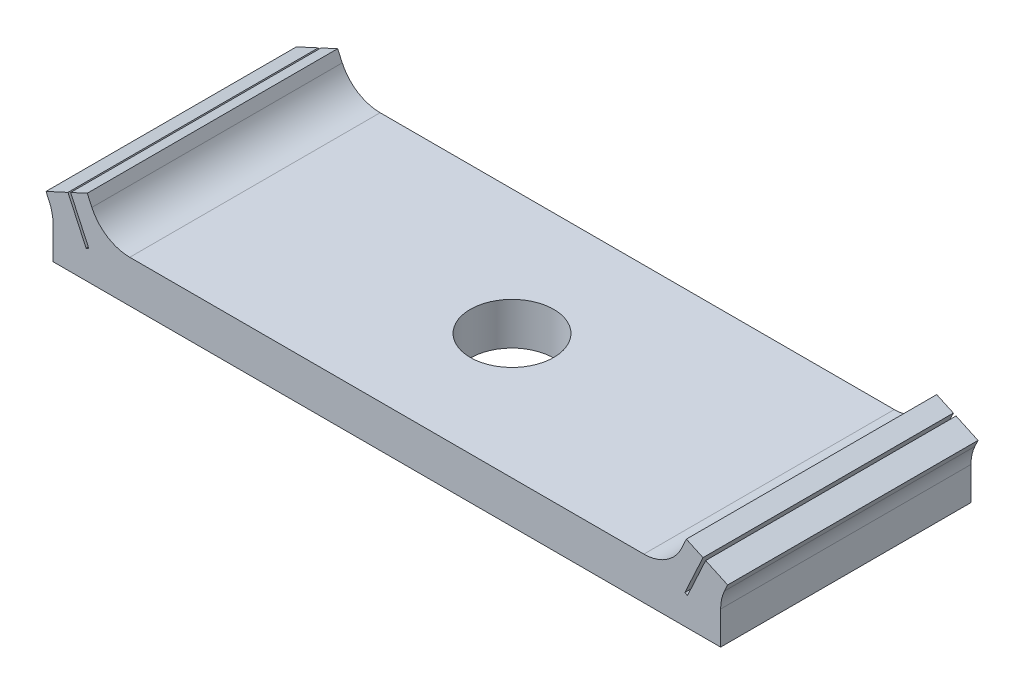
ISO-10303-21;
HEADER;
FILE_DESCRIPTION(('STEP AP214'),'2;1');
FILE_NAME('part.step','',(''),(''),'','','');
FILE_SCHEMA(('AUTOMOTIVE_DESIGN { 1 0 10303 214 1 1 1 1 }'));
ENDSEC;
DATA;
#1=APPLICATION_CONTEXT('core data for automotive mechanical design processes');
#2=APPLICATION_PROTOCOL_DEFINITION('international standard','automotive_design',2000,#1);
#3=PRODUCT_CONTEXT('',#1,'mechanical');
#4=PRODUCT('Part','Part','',(#3));
#5=PRODUCT_RELATED_PRODUCT_CATEGORY('part','',(#4));
#6=PRODUCT_DEFINITION_FORMATION('','',#4);
#7=PRODUCT_DEFINITION_CONTEXT('part definition',#1,'design');
#8=PRODUCT_DEFINITION('design','',#6,#7);
#9=PRODUCT_DEFINITION_SHAPE('','',#8);
#10=(LENGTH_UNIT() NAMED_UNIT(*) SI_UNIT(.MILLI.,.METRE.));
#11=(NAMED_UNIT(*) PLANE_ANGLE_UNIT() SI_UNIT($,.RADIAN.));
#12=(NAMED_UNIT(*) SI_UNIT($,.STERADIAN.) SOLID_ANGLE_UNIT());
#13=UNCERTAINTY_MEASURE_WITH_UNIT(LENGTH_MEASURE(1.E-05),#10,'distance_accuracy_value','');
#14=(GEOMETRIC_REPRESENTATION_CONTEXT(3) GLOBAL_UNCERTAINTY_ASSIGNED_CONTEXT((#13)) GLOBAL_UNIT_ASSIGNED_CONTEXT((#10,
#11,#12)) REPRESENTATION_CONTEXT('',''));
#15=CARTESIAN_POINT('',(0.,0.,0.));
#16=DIRECTION('',(0.,0.,1.));
#17=DIRECTION('',(1.,0.,0.));
#18=AXIS2_PLACEMENT_3D('',#15,#16,#17);
#19=CARTESIAN_POINT('',(0.,2.52883044287948,30.));
#20=DIRECTION('',(0.,1.,0.));
#21=DIRECTION('',(0.,0.,1.));
#22=AXIS2_PLACEMENT_3D('',#19,#20,#21);
#23=PLANE('',#22);
#24=CARTESIAN_POINT('',(0.,2.52883044287948,15.));
#25=DIRECTION('',(0.,1.,0.));
#26=DIRECTION('',(0.,0.,1.));
#27=AXIS2_PLACEMENT_3D('',#24,#25,#26);
#28=CIRCLE('',#27,5.);
#29=CARTESIAN_POINT('',(0.,2.52883044287948,20.));
#30=VERTEX_POINT('',#29);
#31=EDGE_CURVE('E513',#30,#30,#28,.T.);
#32=ORIENTED_EDGE('',*,*,#31,.F.);
#33=EDGE_LOOP('',(#32));
#34=FACE_BOUND('',#33,.T.);
#35=DIRECTION('',(1.,0.,0.));
#36=VECTOR('',#35,1.);
#37=CARTESIAN_POINT('',(0.,2.52883044287948,30.));
#38=LINE('',#37,#36);
#39=CARTESIAN_POINT('',(-30.8011368802658,2.52883044287948,30.));
#40=VERTEX_POINT('',#39);
#41=CARTESIAN_POINT('',(30.8011368802658,2.52883044287948,30.));
#42=VERTEX_POINT('',#41);
#43=EDGE_CURVE('E211',#40,#42,#38,.T.);
#44=ORIENTED_EDGE('',*,*,#43,.T.);
#45=DIRECTION('',(0.,0.,-1.));
#46=VECTOR('',#45,1.);
#47=CARTESIAN_POINT('',(30.8011368802658,2.52883044287948,30.));
#48=LINE('',#47,#46);
#49=CARTESIAN_POINT('',(30.8011368802658,2.52883044287948,0.));
#50=VERTEX_POINT('',#49);
#51=EDGE_CURVE('E394',#42,#50,#48,.T.);
#52=ORIENTED_EDGE('',*,*,#51,.T.);
#53=DIRECTION('',(1.,0.,0.));
#54=VECTOR('',#53,1.);
#55=CARTESIAN_POINT('',(0.,2.52883044287948,0.));
#56=LINE('',#55,#54);
#57=CARTESIAN_POINT('',(-30.8011368802658,2.52883044287948,0.));
#58=VERTEX_POINT('',#57);
#59=EDGE_CURVE('E272',#58,#50,#56,.T.);
#60=ORIENTED_EDGE('',*,*,#59,.F.);
#61=DIRECTION('',(0.,0.,-1.));
#62=VECTOR('',#61,1.);
#63=CARTESIAN_POINT('',(-30.8011368802658,2.52883044287948,30.));
#64=LINE('',#63,#62);
#65=EDGE_CURVE('E391',#58,#40,#64,.F.);
#66=ORIENTED_EDGE('',*,*,#65,.T.);
#67=EDGE_LOOP('',(#44,#52,#60,#66));
#68=FACE_BOUND('',#67,.T.);
#69=ADVANCED_FACE('F44',(#34,#68),#23,.T.);
#70=CARTESIAN_POINT('',(-27.0647454715438,-12.4942055104958,30.));
#71=DIRECTION('',(0.907923839622832,0.419135182780608,0.));
#72=DIRECTION('',(-0.419135182780608,0.907923839622832,0.));
#73=AXIS2_PLACEMENT_3D('',#70,#71,#72);
#74=PLANE('',#73);
#75=DIRECTION('',(0.419135182780608,-0.907923839622832,0.));
#76=VECTOR('',#75,1.);
#77=CARTESIAN_POINT('',(-27.0647454715438,-12.4942055104958,30.));
#78=LINE('',#77,#76);
#79=CARTESIAN_POINT('',(-35.8923161742284,6.62793506895229,30.));
#80=VERTEX_POINT('',#79);
#81=CARTESIAN_POINT('',(-35.3407560783799,5.43315452897644,30.));
#82=VERTEX_POINT('',#81);
#83=EDGE_CURVE('E196',#80,#82,#78,.T.);
#84=ORIENTED_EDGE('',*,*,#83,.T.);
#85=DIRECTION('',(0.,0.,-1.));
#86=VECTOR('',#85,1.);
#87=CARTESIAN_POINT('',(-35.3407560783799,5.43315452897644,0.));
#88=LINE('',#87,#86);
#89=CARTESIAN_POINT('',(-35.3407560783799,5.43315452897644,0.));
#90=VERTEX_POINT('',#89);
#91=EDGE_CURVE('E401',#82,#90,#88,.T.);
#92=ORIENTED_EDGE('',*,*,#91,.T.);
#93=DIRECTION('',(0.419135182780608,-0.907923839622832,0.));
#94=VECTOR('',#93,1.);
#95=CARTESIAN_POINT('',(-27.0647454715438,-12.4942055104958,0.));
#96=LINE('',#95,#94);
#97=CARTESIAN_POINT('',(-35.8923161742284,6.62793506895229,0.));
#98=VERTEX_POINT('',#97);
#99=EDGE_CURVE('E198',#98,#90,#96,.T.);
#100=ORIENTED_EDGE('',*,*,#99,.F.);
#101=DIRECTION('',(0.,0.,-1.));
#102=VECTOR('',#101,1.);
#103=CARTESIAN_POINT('',(-35.8923161742284,6.62793506895229,30.));
#104=LINE('',#103,#102);
#105=EDGE_CURVE('E194',#80,#98,#104,.T.);
#106=ORIENTED_EDGE('',*,*,#105,.F.);
#107=EDGE_LOOP('',(#84,#92,#100,#106));
#108=FACE_BOUND('',#107,.T.);
#109=ADVANCED_FACE('F195',(#108),#74,.T.);
#110=CARTESIAN_POINT('',(-8.82757070268477,19.1221405794482,30.));
#111=DIRECTION('',(-0.419135182780611,0.907923839622831,0.));
#112=DIRECTION('',(-0.907923839622831,-0.419135182780611,0.));
#113=AXIS2_PLACEMENT_3D('',#110,#111,#112);
#114=PLANE('',#113);
#115=DIRECTION('',(0.907923839622831,0.419135182780611,0.));
#116=VECTOR('',#115,1.);
#117=CARTESIAN_POINT('',(-8.82757070268477,19.1221405794482,0.));
#118=LINE('',#117,#116);
#119=CARTESIAN_POINT('',(-37.887517886787,5.70686746616213,0.));
#120=VERTEX_POINT('',#119);
#121=EDGE_CURVE('E278',#120,#98,#118,.T.);
#122=ORIENTED_EDGE('',*,*,#121,.F.);
#123=DIRECTION('',(0.,0.,-1.));
#124=VECTOR('',#123,1.);
#125=CARTESIAN_POINT('',(-37.887517886787,5.70686746616213,30.));
#126=LINE('',#125,#124);
#127=CARTESIAN_POINT('',(-37.887517886787,5.70686746616213,30.));
#128=VERTEX_POINT('',#127);
#129=EDGE_CURVE('E205',#128,#120,#126,.T.);
#130=ORIENTED_EDGE('',*,*,#129,.F.);
#131=DIRECTION('',(0.907923839622831,0.419135182780611,0.));
#132=VECTOR('',#131,1.);
#133=CARTESIAN_POINT('',(-8.82757070268477,19.1221405794482,30.));
#134=LINE('',#133,#132);
#135=EDGE_CURVE('E209',#128,#80,#134,.T.);
#136=ORIENTED_EDGE('',*,*,#135,.T.);
#137=ORIENTED_EDGE('',*,*,#105,.T.);
#138=EDGE_LOOP('',(#122,#130,#136,#137));
#139=FACE_BOUND('',#138,.T.);
#140=ADVANCED_FACE('F213',(#139),#114,.T.);
#141=CARTESIAN_POINT('',(-29.0599471841023,-13.4152731132861,30.));
#142=DIRECTION('',(0.907923839622831,0.419135182780611,0.));
#143=DIRECTION('',(-0.419135182780611,0.907923839622831,0.));
#144=AXIS2_PLACEMENT_3D('',#141,#142,#143);
#145=PLANE('',#144);
#146=DIRECTION('',(0.419135182780611,-0.907923839622831,0.));
#147=VECTOR('',#146,1.);
#148=CARTESIAN_POINT('',(-29.0599471841023,-13.4152731132861,0.));
#149=LINE('',#148,#147);
#150=CARTESIAN_POINT('',(-35.7080149363278,0.985663500123416,0.));
#151=VERTEX_POINT('',#150);
#152=EDGE_CURVE('E281',#120,#151,#149,.T.);
#153=ORIENTED_EDGE('',*,*,#152,.T.);
#154=DIRECTION('',(0.,0.,-1.));
#155=VECTOR('',#154,1.);
#156=CARTESIAN_POINT('',(-35.7080149363278,0.985663500123416,30.));
#157=LINE('',#156,#155);
#158=CARTESIAN_POINT('',(-35.7080149363278,0.985663500123416,30.));
#159=VERTEX_POINT('',#158);
#160=EDGE_CURVE('E372',#159,#151,#157,.T.);
#161=ORIENTED_EDGE('',*,*,#160,.F.);
#162=DIRECTION('',(0.419135182780611,-0.907923839622831,0.));
#163=VECTOR('',#162,1.);
#164=CARTESIAN_POINT('',(-29.0599471841023,-13.4152731132861,30.));
#165=LINE('',#164,#163);
#166=EDGE_CURVE('E216',#128,#159,#165,.T.);
#167=ORIENTED_EDGE('',*,*,#166,.F.);
#168=ORIENTED_EDGE('',*,*,#129,.T.);
#169=EDGE_LOOP('',(#153,#161,#167,#168));
#170=FACE_BOUND('',#169,.T.);
#171=ADVANCED_FACE('F547',(#170),#145,.F.);
#172=CARTESIAN_POINT('',(-6.64806775222578,14.4009366134096,30.));
#173=DIRECTION('',(0.419135182780618,-0.907923839622828,0.));
#174=DIRECTION('',(0.907923839622828,0.419135182780618,0.));
#175=AXIS2_PLACEMENT_3D('',#172,#173,#174);
#176=PLANE('',#175);
#177=DIRECTION('',(-0.907923839622828,-0.419135182780618,0.));
#178=VECTOR('',#177,1.);
#179=CARTESIAN_POINT('',(-6.64806775222578,14.4009366134096,0.));
#180=LINE('',#179,#178);
#181=CARTESIAN_POINT('',(-36.0257882801958,0.838966186150199,0.));
#182=VERTEX_POINT('',#181);
#183=EDGE_CURVE('E284',#151,#182,#180,.T.);
#184=ORIENTED_EDGE('',*,*,#183,.T.);
#185=DIRECTION('',(0.,0.,-1.));
#186=VECTOR('',#185,1.);
#187=CARTESIAN_POINT('',(-36.0257882801958,0.838966186150199,30.));
#188=LINE('',#187,#186);
#189=CARTESIAN_POINT('',(-36.0257882801958,0.838966186150199,30.));
#190=VERTEX_POINT('',#189);
#191=EDGE_CURVE('E368',#190,#182,#188,.T.);
#192=ORIENTED_EDGE('',*,*,#191,.F.);
#193=DIRECTION('',(-0.907923839622828,-0.419135182780618,0.));
#194=VECTOR('',#193,1.);
#195=CARTESIAN_POINT('',(-6.64806775222578,14.4009366134096,30.));
#196=LINE('',#195,#194);
#197=EDGE_CURVE('E219',#159,#190,#196,.T.);
#198=ORIENTED_EDGE('',*,*,#197,.F.);
#199=ORIENTED_EDGE('',*,*,#160,.T.);
#200=EDGE_LOOP('',(#184,#192,#198,#199));
#201=FACE_BOUND('',#200,.T.);
#202=ADVANCED_FACE('F543',(#201),#176,.F.);
#203=CARTESIAN_POINT('',(-29.3777205279702,-13.5619704272593,30.));
#204=DIRECTION('',(-0.90792383962283,-0.419135182780612,0.));
#205=DIRECTION('',(0.419135182780612,-0.90792383962283,0.));
#206=AXIS2_PLACEMENT_3D('',#203,#204,#205);
#207=PLANE('',#206);
#208=DIRECTION('',(-0.419135182780612,0.90792383962283,0.));
#209=VECTOR('',#208,1.);
#210=CARTESIAN_POINT('',(-29.3777205279702,-13.5619704272593,0.));
#211=LINE('',#210,#209);
#212=CARTESIAN_POINT('',(-38.205291230655,5.56017015218892,0.));
#213=VERTEX_POINT('',#212);
#214=EDGE_CURVE('E287',#182,#213,#211,.T.);
#215=ORIENTED_EDGE('',*,*,#214,.T.);
#216=DIRECTION('',(0.,0.,-1.));
#217=VECTOR('',#216,1.);
#218=CARTESIAN_POINT('',(-38.205291230655,5.56017015218892,30.));
#219=LINE('',#218,#217);
#220=CARTESIAN_POINT('',(-38.205291230655,5.56017015218892,30.));
#221=VERTEX_POINT('',#220);
#222=EDGE_CURVE('E365',#221,#213,#219,.T.);
#223=ORIENTED_EDGE('',*,*,#222,.F.);
#224=DIRECTION('',(-0.419135182780612,0.90792383962283,0.));
#225=VECTOR('',#224,1.);
#226=CARTESIAN_POINT('',(-29.3777205279702,-13.5619704272593,30.));
#227=LINE('',#226,#225);
#228=EDGE_CURVE('E225',#190,#221,#227,.T.);
#229=ORIENTED_EDGE('',*,*,#228,.F.);
#230=ORIENTED_EDGE('',*,*,#191,.T.);
#231=EDGE_LOOP('',(#215,#223,#229,#230));
#232=FACE_BOUND('',#231,.T.);
#233=ADVANCED_FACE('F539',(#232),#207,.F.);
#234=CARTESIAN_POINT('',(-8.82757070268477,19.1221405794482,30.));
#235=DIRECTION('',(-0.419135182780611,0.907923839622831,0.));
#236=DIRECTION('',(-0.907923839622831,-0.419135182780611,0.));
#237=AXIS2_PLACEMENT_3D('',#234,#235,#236);
#238=PLANE('',#237);
#239=DIRECTION('',(0.907923839622831,0.419135182780611,0.));
#240=VECTOR('',#239,1.);
#241=CARTESIAN_POINT('',(-8.82757070268477,19.1221405794482,0.));
#242=LINE('',#241,#240);
#243=CARTESIAN_POINT('',(-40.8382703655612,4.34467812212515,0.));
#244=VERTEX_POINT('',#243);
#245=EDGE_CURVE('E291',#244,#213,#242,.T.);
#246=ORIENTED_EDGE('',*,*,#245,.F.);
#247=DIRECTION('',(0.,0.,-1.));
#248=VECTOR('',#247,1.);
#249=CARTESIAN_POINT('',(-40.8382703655612,4.34467812212515,30.));
#250=LINE('',#249,#248);
#251=CARTESIAN_POINT('',(-40.8382703655612,4.34467812212515,30.));
#252=VERTEX_POINT('',#251);
#253=EDGE_CURVE('E361',#252,#244,#250,.T.);
#254=ORIENTED_EDGE('',*,*,#253,.F.);
#255=DIRECTION('',(0.907923839622831,0.419135182780611,0.));
#256=VECTOR('',#255,1.);
#257=CARTESIAN_POINT('',(-8.82757070268477,19.1221405794482,30.));
#258=LINE('',#257,#256);
#259=EDGE_CURVE('E228',#252,#221,#258,.T.);
#260=ORIENTED_EDGE('',*,*,#259,.T.);
#261=ORIENTED_EDGE('',*,*,#222,.T.);
#262=EDGE_LOOP('',(#246,#254,#260,#261));
#263=FACE_BOUND('',#262,.T.);
#264=ADVANCED_FACE('F535',(#263),#238,.T.);
#265=CARTESIAN_POINT('',(-32.0106996628765,-14.777462457323,30.));
#266=DIRECTION('',(-0.907923839622831,-0.419135182780611,0.));
#267=DIRECTION('',(0.419135182780611,-0.907923839622831,0.));
#268=AXIS2_PLACEMENT_3D('',#265,#266,#267);
#269=PLANE('',#268);
#270=DIRECTION('',(-0.419135182780611,0.907923839622831,0.));
#271=VECTOR('',#270,1.);
#272=CARTESIAN_POINT('',(-32.0106996628765,-14.777462457323,0.));
#273=LINE('',#272,#271);
#274=CARTESIAN_POINT('',(-40.4603808018859,3.52609987410171,0.));
#275=VERTEX_POINT('',#274);
#276=EDGE_CURVE('E295',#275,#244,#273,.T.);
#277=ORIENTED_EDGE('',*,*,#276,.F.);
#278=DIRECTION('',(0.,0.,-1.));
#279=VECTOR('',#278,1.);
#280=CARTESIAN_POINT('',(-40.4603808018859,3.52609987410171,30.));
#281=LINE('',#280,#279);
#282=CARTESIAN_POINT('',(-40.4603808018859,3.52609987410171,30.));
#283=VERTEX_POINT('',#282);
#284=EDGE_CURVE('E388',#275,#283,#281,.F.);
#285=ORIENTED_EDGE('',*,*,#284,.T.);
#286=DIRECTION('',(-0.419135182780611,0.907923839622831,0.));
#287=VECTOR('',#286,1.);
#288=CARTESIAN_POINT('',(-32.0106996628765,-14.777462457323,30.));
#289=LINE('',#288,#287);
#290=EDGE_CURVE('E232',#283,#252,#289,.T.);
#291=ORIENTED_EDGE('',*,*,#290,.T.);
#292=ORIENTED_EDGE('',*,*,#253,.T.);
#293=EDGE_LOOP('',(#277,#285,#291,#292));
#294=FACE_BOUND('',#293,.T.);
#295=ADVANCED_FACE('F529',(#294),#269,.T.);
#296=CARTESIAN_POINT('',(-40.,0.,30.));
#297=DIRECTION('',(-1.,0.,0.));
#298=DIRECTION('',(0.,-1.,0.));
#299=AXIS2_PLACEMENT_3D('',#296,#297,#298);
#300=PLANE('',#299);
#301=DIRECTION('',(0.,1.,0.));
#302=VECTOR('',#301,1.);
#303=CARTESIAN_POINT('',(-40.,0.,30.));
#304=LINE('',#303,#302);
#305=CARTESIAN_POINT('',(-40.,-2.52883044287948,30.));
#306=VERTEX_POINT('',#305);
#307=CARTESIAN_POINT('',(-40.,1.43042396019865,30.));
#308=VERTEX_POINT('',#307);
#309=EDGE_CURVE('E235',#306,#308,#304,.T.);
#310=ORIENTED_EDGE('',*,*,#309,.T.);
#311=DIRECTION('',(0.,0.,-1.));
#312=VECTOR('',#311,1.);
#313=CARTESIAN_POINT('',(-40.,1.43042396019865,0.));
#314=LINE('',#313,#312);
#315=CARTESIAN_POINT('',(-40.,1.43042396019865,0.));
#316=VERTEX_POINT('',#315);
#317=EDGE_CURVE('E384',#308,#316,#314,.T.);
#318=ORIENTED_EDGE('',*,*,#317,.T.);
#319=DIRECTION('',(0.,1.,0.));
#320=VECTOR('',#319,1.);
#321=CARTESIAN_POINT('',(-40.,0.,0.));
#322=LINE('',#321,#320);
#323=CARTESIAN_POINT('',(-40.,-2.52883044287948,0.));
#324=VERTEX_POINT('',#323);
#325=EDGE_CURVE('E298',#324,#316,#322,.T.);
#326=ORIENTED_EDGE('',*,*,#325,.F.);
#327=DIRECTION('',(0.,0.,-1.));
#328=VECTOR('',#327,1.);
#329=CARTESIAN_POINT('',(-40.,-2.52883044287948,30.));
#330=LINE('',#329,#328);
#331=EDGE_CURVE('E358',#306,#324,#330,.T.);
#332=ORIENTED_EDGE('',*,*,#331,.F.);
#333=EDGE_LOOP('',(#310,#318,#326,#332));
#334=FACE_BOUND('',#333,.T.);
#335=ADVANCED_FACE('F466',(#334),#300,.T.);
#336=CARTESIAN_POINT('',(0.,-2.52883044287948,30.));
#337=DIRECTION('',(0.,1.,0.));
#338=DIRECTION('',(0.,0.,1.));
#339=AXIS2_PLACEMENT_3D('',#336,#337,#338);
#340=PLANE('',#339);
#341=CARTESIAN_POINT('',(0.,-2.52883044287948,15.));
#342=DIRECTION('',(0.,1.,0.));
#343=DIRECTION('',(0.,0.,1.));
#344=AXIS2_PLACEMENT_3D('',#341,#342,#343);
#345=CIRCLE('',#344,5.);
#346=CARTESIAN_POINT('',(0.,-2.52883044287948,20.));
#347=VERTEX_POINT('',#346);
#348=EDGE_CURVE('E48',#347,#347,#345,.T.);
#349=ORIENTED_EDGE('',*,*,#348,.T.);
#350=EDGE_LOOP('',(#349));
#351=FACE_BOUND('',#350,.T.);
#352=DIRECTION('',(1.,0.,0.));
#353=VECTOR('',#352,1.);
#354=CARTESIAN_POINT('',(0.,-2.52883044287948,0.));
#355=LINE('',#354,#353);
#356=CARTESIAN_POINT('',(40.,-2.52883044287948,0.));
#357=VERTEX_POINT('',#356);
#358=EDGE_CURVE('E302',#324,#357,#355,.T.);
#359=ORIENTED_EDGE('',*,*,#358,.T.);
#360=DIRECTION('',(0.,0.,-1.));
#361=VECTOR('',#360,1.);
#362=CARTESIAN_POINT('',(40.,-2.52883044287948,30.));
#363=LINE('',#362,#361);
#364=CARTESIAN_POINT('',(40.,-2.52883044287948,30.));
#365=VERTEX_POINT('',#364);
#366=EDGE_CURVE('E354',#365,#357,#363,.T.);
#367=ORIENTED_EDGE('',*,*,#366,.F.);
#368=DIRECTION('',(1.,0.,0.));
#369=VECTOR('',#368,1.);
#370=CARTESIAN_POINT('',(0.,-2.52883044287948,30.));
#371=LINE('',#370,#369);
#372=EDGE_CURVE('E239',#306,#365,#371,.T.);
#373=ORIENTED_EDGE('',*,*,#372,.F.);
#374=ORIENTED_EDGE('',*,*,#331,.T.);
#375=EDGE_LOOP('',(#359,#367,#373,#374));
#376=FACE_BOUND('',#375,.T.);
#377=ADVANCED_FACE('F472',(#351,#376),#340,.F.);
#378=CARTESIAN_POINT('',(40.,0.,30.));
#379=DIRECTION('',(-1.,0.,0.));
#380=DIRECTION('',(0.,0.,1.));
#381=AXIS2_PLACEMENT_3D('',#378,#379,#380);
#382=PLANE('',#381);
#383=DIRECTION('',(0.,1.,0.));
#384=VECTOR('',#383,1.);
#385=CARTESIAN_POINT('',(40.,0.,0.));
#386=LINE('',#385,#384);
#387=CARTESIAN_POINT('',(40.,1.4304239601986,0.));
#388=VERTEX_POINT('',#387);
#389=EDGE_CURVE('E305',#357,#388,#386,.T.);
#390=ORIENTED_EDGE('',*,*,#389,.T.);
#391=DIRECTION('',(0.,0.,-1.));
#392=VECTOR('',#391,1.);
#393=CARTESIAN_POINT('',(40.,1.4304239601986,30.));
#394=LINE('',#393,#392);
#395=CARTESIAN_POINT('',(40.,1.4304239601986,30.));
#396=VERTEX_POINT('',#395);
#397=EDGE_CURVE('E381',#388,#396,#394,.F.);
#398=ORIENTED_EDGE('',*,*,#397,.T.);
#399=DIRECTION('',(0.,1.,0.));
#400=VECTOR('',#399,1.);
#401=CARTESIAN_POINT('',(40.,0.,30.));
#402=LINE('',#401,#400);
#403=EDGE_CURVE('E242',#365,#396,#402,.T.);
#404=ORIENTED_EDGE('',*,*,#403,.F.);
#405=ORIENTED_EDGE('',*,*,#366,.T.);
#406=EDGE_LOOP('',(#390,#398,#404,#405));
#407=FACE_BOUND('',#406,.T.);
#408=ADVANCED_FACE('F521',(#407),#382,.F.);
#409=CARTESIAN_POINT('',(32.0106996628765,-14.777462457323,30.));
#410=DIRECTION('',(-0.907923839622831,0.419135182780611,0.));
#411=DIRECTION('',(-0.419135182780611,-0.907923839622831,0.));
#412=AXIS2_PLACEMENT_3D('',#409,#410,#411);
#413=PLANE('',#412);
#414=DIRECTION('',(0.419135182780611,0.907923839622831,0.));
#415=VECTOR('',#414,1.);
#416=CARTESIAN_POINT('',(32.0106996628765,-14.777462457323,30.));
#417=LINE('',#416,#415);
#418=CARTESIAN_POINT('',(40.4603808018858,3.52609987410166,30.));
#419=VERTEX_POINT('',#418);
#420=CARTESIAN_POINT('',(40.8382703655612,4.34467812212514,30.));
#421=VERTEX_POINT('',#420);
#422=EDGE_CURVE('E246',#419,#421,#417,.T.);
#423=ORIENTED_EDGE('',*,*,#422,.F.);
#424=DIRECTION('',(0.,0.,-1.));
#425=VECTOR('',#424,1.);
#426=CARTESIAN_POINT('',(40.4603808018858,3.52609987410166,0.));
#427=LINE('',#426,#425);
#428=CARTESIAN_POINT('',(40.4603808018858,3.52609987410166,0.));
#429=VERTEX_POINT('',#428);
#430=EDGE_CURVE('E204',#419,#429,#427,.T.);
#431=ORIENTED_EDGE('',*,*,#430,.T.);
#432=DIRECTION('',(0.419135182780611,0.907923839622831,0.));
#433=VECTOR('',#432,1.);
#434=CARTESIAN_POINT('',(32.0106996628765,-14.777462457323,0.));
#435=LINE('',#434,#433);
#436=CARTESIAN_POINT('',(40.8382703655612,4.34467812212514,0.));
#437=VERTEX_POINT('',#436);
#438=EDGE_CURVE('E309',#429,#437,#435,.T.);
#439=ORIENTED_EDGE('',*,*,#438,.T.);
#440=DIRECTION('',(0.,0.,-1.));
#441=VECTOR('',#440,1.);
#442=CARTESIAN_POINT('',(40.8382703655612,4.34467812212514,30.));
#443=LINE('',#442,#441);
#444=EDGE_CURVE('E350',#421,#437,#443,.T.);
#445=ORIENTED_EDGE('',*,*,#444,.F.);
#446=EDGE_LOOP('',(#423,#431,#439,#445));
#447=FACE_BOUND('',#446,.T.);
#448=ADVANCED_FACE('F481',(#447),#413,.F.);
#449=CARTESIAN_POINT('',(8.82757070268476,19.1221405794482,30.));
#450=DIRECTION('',(-0.419135182780611,-0.907923839622831,0.));
#451=DIRECTION('',(0.907923839622831,-0.419135182780611,0.));
#452=AXIS2_PLACEMENT_3D('',#449,#450,#451);
#453=PLANE('',#452);
#454=DIRECTION('',(-0.907923839622831,0.419135182780611,0.));
#455=VECTOR('',#454,1.);
#456=CARTESIAN_POINT('',(8.82757070268476,19.1221405794482,0.));
#457=LINE('',#456,#455);
#458=CARTESIAN_POINT('',(38.205291230655,5.56017015218892,0.));
#459=VERTEX_POINT('',#458);
#460=EDGE_CURVE('E312',#437,#459,#457,.T.);
#461=ORIENTED_EDGE('',*,*,#460,.T.);
#462=DIRECTION('',(0.,0.,-1.));
#463=VECTOR('',#462,1.);
#464=CARTESIAN_POINT('',(38.205291230655,5.56017015218892,30.));
#465=LINE('',#464,#463);
#466=CARTESIAN_POINT('',(38.205291230655,5.56017015218892,30.));
#467=VERTEX_POINT('',#466);
#468=EDGE_CURVE('E347',#467,#459,#465,.T.);
#469=ORIENTED_EDGE('',*,*,#468,.F.);
#470=DIRECTION('',(-0.907923839622831,0.419135182780611,0.));
#471=VECTOR('',#470,1.);
#472=CARTESIAN_POINT('',(8.82757070268476,19.1221405794482,30.));
#473=LINE('',#472,#471);
#474=EDGE_CURVE('E249',#421,#467,#473,.T.);
#475=ORIENTED_EDGE('',*,*,#474,.F.);
#476=ORIENTED_EDGE('',*,*,#444,.T.);
#477=EDGE_LOOP('',(#461,#469,#475,#476));
#478=FACE_BOUND('',#477,.T.);
#479=ADVANCED_FACE('F488',(#478),#453,.F.);
#480=CARTESIAN_POINT('',(29.3777205279702,-13.5619704272593,30.));
#481=DIRECTION('',(-0.90792383962283,0.419135182780612,0.));
#482=DIRECTION('',(-0.419135182780612,-0.90792383962283,0.));
#483=AXIS2_PLACEMENT_3D('',#480,#481,#482);
#484=PLANE('',#483);
#485=DIRECTION('',(0.419135182780612,0.90792383962283,0.));
#486=VECTOR('',#485,1.);
#487=CARTESIAN_POINT('',(29.3777205279702,-13.5619704272593,0.));
#488=LINE('',#487,#486);
#489=CARTESIAN_POINT('',(36.0257882801958,0.838966186150194,0.));
#490=VERTEX_POINT('',#489);
#491=EDGE_CURVE('E316',#490,#459,#488,.T.);
#492=ORIENTED_EDGE('',*,*,#491,.F.);
#493=DIRECTION('',(0.,0.,-1.));
#494=VECTOR('',#493,1.);
#495=CARTESIAN_POINT('',(36.0257882801958,0.838966186150194,30.));
#496=LINE('',#495,#494);
#497=CARTESIAN_POINT('',(36.0257882801958,0.838966186150194,30.));
#498=VERTEX_POINT('',#497);
#499=EDGE_CURVE('E344',#498,#490,#496,.T.);
#500=ORIENTED_EDGE('',*,*,#499,.F.);
#501=DIRECTION('',(0.419135182780612,0.90792383962283,0.));
#502=VECTOR('',#501,1.);
#503=CARTESIAN_POINT('',(29.3777205279702,-13.5619704272593,30.));
#504=LINE('',#503,#502);
#505=EDGE_CURVE('E252',#498,#467,#504,.T.);
#506=ORIENTED_EDGE('',*,*,#505,.T.);
#507=ORIENTED_EDGE('',*,*,#468,.T.);
#508=EDGE_LOOP('',(#492,#500,#506,#507));
#509=FACE_BOUND('',#508,.T.);
#510=ADVANCED_FACE('F601',(#509),#484,.T.);
#511=CARTESIAN_POINT('',(6.64806775222562,14.4009366134095,30.));
#512=DIRECTION('',(0.419135182780612,0.90792383962283,0.));
#513=DIRECTION('',(-0.90792383962283,0.419135182780612,0.));
#514=AXIS2_PLACEMENT_3D('',#511,#512,#513);
#515=PLANE('',#514);
#516=DIRECTION('',(0.90792383962283,-0.419135182780612,0.));
#517=VECTOR('',#516,1.);
#518=CARTESIAN_POINT('',(6.64806775222562,14.4009366134095,0.));
#519=LINE('',#518,#517);
#520=CARTESIAN_POINT('',(35.7080149363279,0.985663500123404,0.));
#521=VERTEX_POINT('',#520);
#522=EDGE_CURVE('E320',#521,#490,#519,.T.);
#523=ORIENTED_EDGE('',*,*,#522,.F.);
#524=DIRECTION('',(0.,0.,-1.));
#525=VECTOR('',#524,1.);
#526=CARTESIAN_POINT('',(35.7080149363279,0.985663500123404,30.));
#527=LINE('',#526,#525);
#528=CARTESIAN_POINT('',(35.7080149363279,0.985663500123404,30.));
#529=VERTEX_POINT('',#528);
#530=EDGE_CURVE('E341',#529,#521,#527,.T.);
#531=ORIENTED_EDGE('',*,*,#530,.F.);
#532=DIRECTION('',(0.90792383962283,-0.419135182780612,0.));
#533=VECTOR('',#532,1.);
#534=CARTESIAN_POINT('',(6.64806775222562,14.4009366134095,30.));
#535=LINE('',#534,#533);
#536=EDGE_CURVE('E256',#529,#498,#535,.T.);
#537=ORIENTED_EDGE('',*,*,#536,.T.);
#538=ORIENTED_EDGE('',*,*,#499,.T.);
#539=EDGE_LOOP('',(#523,#531,#537,#538));
#540=FACE_BOUND('',#539,.T.);
#541=ADVANCED_FACE('F496',(#540),#515,.T.);
#542=CARTESIAN_POINT('',(29.0599471841023,-13.415273113286,30.));
#543=DIRECTION('',(0.907923839622832,-0.41913518278061,0.));
#544=DIRECTION('',(0.41913518278061,0.907923839622832,0.));
#545=AXIS2_PLACEMENT_3D('',#542,#543,#544);
#546=PLANE('',#545);
#547=DIRECTION('',(-0.41913518278061,-0.907923839622832,0.));
#548=VECTOR('',#547,1.);
#549=CARTESIAN_POINT('',(29.0599471841023,-13.415273113286,0.));
#550=LINE('',#549,#548);
#551=CARTESIAN_POINT('',(37.887517886787,5.70686746616213,0.));
#552=VERTEX_POINT('',#551);
#553=EDGE_CURVE('E324',#552,#521,#550,.T.);
#554=ORIENTED_EDGE('',*,*,#553,.F.);
#555=DIRECTION('',(0.,0.,-1.));
#556=VECTOR('',#555,1.);
#557=CARTESIAN_POINT('',(37.887517886787,5.70686746616213,30.));
#558=LINE('',#557,#556);
#559=CARTESIAN_POINT('',(37.887517886787,5.70686746616213,30.));
#560=VERTEX_POINT('',#559);
#561=EDGE_CURVE('E338',#560,#552,#558,.T.);
#562=ORIENTED_EDGE('',*,*,#561,.F.);
#563=DIRECTION('',(-0.41913518278061,-0.907923839622832,0.));
#564=VECTOR('',#563,1.);
#565=CARTESIAN_POINT('',(29.0599471841023,-13.415273113286,30.));
#566=LINE('',#565,#564);
#567=EDGE_CURVE('E260',#560,#529,#566,.T.);
#568=ORIENTED_EDGE('',*,*,#567,.T.);
#569=ORIENTED_EDGE('',*,*,#530,.T.);
#570=EDGE_LOOP('',(#554,#562,#568,#569));
#571=FACE_BOUND('',#570,.T.);
#572=ADVANCED_FACE('F499',(#571),#546,.T.);
#573=CARTESIAN_POINT('',(8.82757070268476,19.1221405794482,30.));
#574=DIRECTION('',(-0.419135182780611,-0.907923839622831,0.));
#575=DIRECTION('',(0.907923839622831,-0.419135182780611,0.));
#576=AXIS2_PLACEMENT_3D('',#573,#574,#575);
#577=PLANE('',#576);
#578=DIRECTION('',(-0.907923839622831,0.419135182780611,0.));
#579=VECTOR('',#578,1.);
#580=CARTESIAN_POINT('',(8.82757070268476,19.1221405794482,0.));
#581=LINE('',#580,#579);
#582=CARTESIAN_POINT('',(35.8923161742284,6.62793506895229,0.));
#583=VERTEX_POINT('',#582);
#584=EDGE_CURVE('E328',#552,#583,#581,.T.);
#585=ORIENTED_EDGE('',*,*,#584,.T.);
#586=DIRECTION('',(0.,0.,-1.));
#587=VECTOR('',#586,1.);
#588=CARTESIAN_POINT('',(35.8923161742284,6.62793506895229,30.));
#589=LINE('',#588,#587);
#590=CARTESIAN_POINT('',(35.8923161742284,6.62793506895229,30.));
#591=VERTEX_POINT('',#590);
#592=EDGE_CURVE('E271',#591,#583,#589,.T.);
#593=ORIENTED_EDGE('',*,*,#592,.F.);
#594=DIRECTION('',(-0.907923839622831,0.419135182780611,0.));
#595=VECTOR('',#594,1.);
#596=CARTESIAN_POINT('',(8.82757070268476,19.1221405794482,30.));
#597=LINE('',#596,#595);
#598=EDGE_CURVE('E264',#560,#591,#597,.T.);
#599=ORIENTED_EDGE('',*,*,#598,.F.);
#600=ORIENTED_EDGE('',*,*,#561,.T.);
#601=EDGE_LOOP('',(#585,#593,#599,#600));
#602=FACE_BOUND('',#601,.T.);
#603=ADVANCED_FACE('F505',(#602),#577,.F.);
#604=CARTESIAN_POINT('',(27.0647454715438,-12.4942055104958,30.));
#605=DIRECTION('',(0.907923839622832,-0.419135182780608,0.));
#606=DIRECTION('',(0.419135182780608,0.907923839622832,0.));
#607=AXIS2_PLACEMENT_3D('',#604,#605,#606);
#608=PLANE('',#607);
#609=DIRECTION('',(-0.419135182780608,-0.907923839622832,0.));
#610=VECTOR('',#609,1.);
#611=CARTESIAN_POINT('',(27.0647454715438,-12.4942055104958,0.));
#612=LINE('',#611,#610);
#613=CARTESIAN_POINT('',(35.3407560783799,5.43315452897643,0.));
#614=VERTEX_POINT('',#613);
#615=EDGE_CURVE('E331',#583,#614,#612,.T.);
#616=ORIENTED_EDGE('',*,*,#615,.T.);
#617=DIRECTION('',(0.,0.,-1.));
#618=VECTOR('',#617,1.);
#619=CARTESIAN_POINT('',(35.3407560783799,5.43315452897644,30.));
#620=LINE('',#619,#618);
#621=CARTESIAN_POINT('',(35.3407560783799,5.43315452897643,30.));
#622=VERTEX_POINT('',#621);
#623=EDGE_CURVE('E398',#614,#622,#620,.F.);
#624=ORIENTED_EDGE('',*,*,#623,.T.);
#625=DIRECTION('',(-0.419135182780608,-0.907923839622832,0.));
#626=VECTOR('',#625,1.);
#627=CARTESIAN_POINT('',(27.0647454715438,-12.4942055104958,30.));
#628=LINE('',#627,#626);
#629=EDGE_CURVE('E267',#591,#622,#628,.T.);
#630=ORIENTED_EDGE('',*,*,#629,.F.);
#631=ORIENTED_EDGE('',*,*,#592,.T.);
#632=EDGE_LOOP('',(#616,#624,#630,#631));
#633=FACE_BOUND('',#632,.T.);
#634=ADVANCED_FACE('F509',(#633),#608,.F.);
#635=CARTESIAN_POINT('',(0.,0.,30.));
#636=DIRECTION('',(0.,0.,1.));
#637=DIRECTION('',(1.,0.,0.));
#638=AXIS2_PLACEMENT_3D('',#635,#636,#637);
#639=PLANE('',#638);
#640=ORIENTED_EDGE('',*,*,#43,.F.);
#641=CARTESIAN_POINT('',(-30.8011368802658,7.52883044287948,30.));
#642=DIRECTION('',(0.,0.,1.));
#643=DIRECTION('',(1.,0.,0.));
#644=AXIS2_PLACEMENT_3D('',#641,#642,#643);
#645=CIRCLE('',#644,5.);
#646=EDGE_CURVE('E11',#40,#82,#645,.F.);
#647=ORIENTED_EDGE('',*,*,#646,.T.);
#648=ORIENTED_EDGE('',*,*,#83,.F.);
#649=ORIENTED_EDGE('',*,*,#135,.F.);
#650=ORIENTED_EDGE('',*,*,#166,.T.);
#651=ORIENTED_EDGE('',*,*,#197,.T.);
#652=ORIENTED_EDGE('',*,*,#228,.T.);
#653=ORIENTED_EDGE('',*,*,#259,.F.);
#654=ORIENTED_EDGE('',*,*,#290,.F.);
#655=CARTESIAN_POINT('',(-45.,1.43042396019866,30.));
#656=DIRECTION('',(0.,0.,1.));
#657=DIRECTION('',(1.,0.,0.));
#658=AXIS2_PLACEMENT_3D('',#655,#656,#657);
#659=CIRCLE('',#658,5.);
#660=EDGE_CURVE('E413',#283,#308,#659,.F.);
#661=ORIENTED_EDGE('',*,*,#660,.T.);
#662=ORIENTED_EDGE('',*,*,#309,.F.);
#663=ORIENTED_EDGE('',*,*,#372,.T.);
#664=ORIENTED_EDGE('',*,*,#403,.T.);
#665=CARTESIAN_POINT('',(45.,1.4304239601986,30.));
#666=DIRECTION('',(0.,0.,1.));
#667=DIRECTION('',(1.,0.,0.));
#668=AXIS2_PLACEMENT_3D('',#665,#666,#667);
#669=CIRCLE('',#668,5.);
#670=EDGE_CURVE('E407',#396,#419,#669,.F.);
#671=ORIENTED_EDGE('',*,*,#670,.T.);
#672=ORIENTED_EDGE('',*,*,#422,.T.);
#673=ORIENTED_EDGE('',*,*,#474,.T.);
#674=ORIENTED_EDGE('',*,*,#505,.F.);
#675=ORIENTED_EDGE('',*,*,#536,.F.);
#676=ORIENTED_EDGE('',*,*,#567,.F.);
#677=ORIENTED_EDGE('',*,*,#598,.T.);
#678=ORIENTED_EDGE('',*,*,#629,.T.);
#679=CARTESIAN_POINT('',(30.8011368802658,7.52883044287948,30.));
#680=DIRECTION('',(0.,0.,1.));
#681=DIRECTION('',(1.,0.,0.));
#682=AXIS2_PLACEMENT_3D('',#679,#680,#681);
#683=CIRCLE('',#682,5.);
#684=EDGE_CURVE('E419',#622,#42,#683,.F.);
#685=ORIENTED_EDGE('',*,*,#684,.T.);
#686=EDGE_LOOP('',(#640,#647,#648,#649,#650,#651,#652,#653,#654,#661,#662,#663,#664,#671,#672,
#673,#674,#675,#676,#677,#678,#685));
#687=FACE_BOUND('',#686,.T.);
#688=ADVANCED_FACE('F208',(#687),#639,.T.);
#689=CARTESIAN_POINT('',(0.,0.,0.));
#690=DIRECTION('',(0.,0.,1.));
#691=DIRECTION('',(1.,0.,0.));
#692=AXIS2_PLACEMENT_3D('',#689,#690,#691);
#693=PLANE('',#692);
#694=ORIENTED_EDGE('',*,*,#99,.T.);
#695=CARTESIAN_POINT('',(-30.8011368802658,7.52883044287948,0.));
#696=DIRECTION('',(0.,0.,1.));
#697=DIRECTION('',(1.,0.,0.));
#698=AXIS2_PLACEMENT_3D('',#695,#696,#697);
#699=CIRCLE('',#698,5.);
#700=EDGE_CURVE('E54',#90,#58,#699,.T.);
#701=ORIENTED_EDGE('',*,*,#700,.T.);
#702=ORIENTED_EDGE('',*,*,#59,.T.);
#703=CARTESIAN_POINT('',(30.8011368802658,7.52883044287948,0.));
#704=DIRECTION('',(0.,0.,1.));
#705=DIRECTION('',(1.,0.,0.));
#706=AXIS2_PLACEMENT_3D('',#703,#704,#705);
#707=CIRCLE('',#706,5.);
#708=EDGE_CURVE('E416',#50,#614,#707,.T.);
#709=ORIENTED_EDGE('',*,*,#708,.T.);
#710=ORIENTED_EDGE('',*,*,#615,.F.);
#711=ORIENTED_EDGE('',*,*,#584,.F.);
#712=ORIENTED_EDGE('',*,*,#553,.T.);
#713=ORIENTED_EDGE('',*,*,#522,.T.);
#714=ORIENTED_EDGE('',*,*,#491,.T.);
#715=ORIENTED_EDGE('',*,*,#460,.F.);
#716=ORIENTED_EDGE('',*,*,#438,.F.);
#717=CARTESIAN_POINT('',(45.,1.4304239601986,0.));
#718=DIRECTION('',(0.,0.,1.));
#719=DIRECTION('',(1.,0.,0.));
#720=AXIS2_PLACEMENT_3D('',#717,#718,#719);
#721=CIRCLE('',#720,5.);
#722=EDGE_CURVE('E404',#429,#388,#721,.T.);
#723=ORIENTED_EDGE('',*,*,#722,.T.);
#724=ORIENTED_EDGE('',*,*,#389,.F.);
#725=ORIENTED_EDGE('',*,*,#358,.F.);
#726=ORIENTED_EDGE('',*,*,#325,.T.);
#727=CARTESIAN_POINT('',(-45.,1.43042396019866,0.));
#728=DIRECTION('',(0.,0.,1.));
#729=DIRECTION('',(1.,0.,0.));
#730=AXIS2_PLACEMENT_3D('',#727,#728,#729);
#731=CIRCLE('',#730,5.);
#732=EDGE_CURVE('E410',#316,#275,#731,.T.);
#733=ORIENTED_EDGE('',*,*,#732,.T.);
#734=ORIENTED_EDGE('',*,*,#276,.T.);
#735=ORIENTED_EDGE('',*,*,#245,.T.);
#736=ORIENTED_EDGE('',*,*,#214,.F.);
#737=ORIENTED_EDGE('',*,*,#183,.F.);
#738=ORIENTED_EDGE('',*,*,#152,.F.);
#739=ORIENTED_EDGE('',*,*,#121,.T.);
#740=EDGE_LOOP('',(#694,#701,#702,#709,#710,#711,#712,#713,#714,#715,#716,#723,#724,#725,#726,
#733,#734,#735,#736,#737,#738,#739));
#741=FACE_BOUND('',#740,.T.);
#742=ADVANCED_FACE('F425',(#741),#693,.F.);
#743=CARTESIAN_POINT('',(45.,1.4304239601986,30.));
#744=DIRECTION('',(0.,0.,1.));
#745=DIRECTION('',(1.,0.,0.));
#746=AXIS2_PLACEMENT_3D('',#743,#744,#745);
#747=CYLINDRICAL_SURFACE('',#746,5.);
#748=ORIENTED_EDGE('',*,*,#670,.F.);
#749=ORIENTED_EDGE('',*,*,#397,.F.);
#750=ORIENTED_EDGE('',*,*,#722,.F.);
#751=ORIENTED_EDGE('',*,*,#430,.F.);
#752=EDGE_LOOP('',(#748,#749,#750,#751));
#753=FACE_BOUND('',#752,.T.);
#754=ADVANCED_FACE('F451',(#753),#747,.F.);
#755=CARTESIAN_POINT('',(-45.,1.43042396019866,30.));
#756=DIRECTION('',(0.,0.,1.));
#757=DIRECTION('',(1.,0.,0.));
#758=AXIS2_PLACEMENT_3D('',#755,#756,#757);
#759=CYLINDRICAL_SURFACE('',#758,5.);
#760=ORIENTED_EDGE('',*,*,#660,.F.);
#761=ORIENTED_EDGE('',*,*,#284,.F.);
#762=ORIENTED_EDGE('',*,*,#732,.F.);
#763=ORIENTED_EDGE('',*,*,#317,.F.);
#764=EDGE_LOOP('',(#760,#761,#762,#763));
#765=FACE_BOUND('',#764,.T.);
#766=ADVANCED_FACE('F438',(#765),#759,.F.);
#767=CARTESIAN_POINT('',(30.8011368802658,7.52883044287948,30.));
#768=DIRECTION('',(0.,0.,-1.));
#769=DIRECTION('',(-1.,0.,0.));
#770=AXIS2_PLACEMENT_3D('',#767,#768,#769);
#771=CYLINDRICAL_SURFACE('',#770,5.);
#772=ORIENTED_EDGE('',*,*,#684,.F.);
#773=ORIENTED_EDGE('',*,*,#623,.F.);
#774=ORIENTED_EDGE('',*,*,#708,.F.);
#775=ORIENTED_EDGE('',*,*,#51,.F.);
#776=EDGE_LOOP('',(#772,#773,#774,#775));
#777=FACE_BOUND('',#776,.T.);
#778=ADVANCED_FACE('F431',(#777),#771,.F.);
#779=CARTESIAN_POINT('',(-30.8011368802658,7.52883044287948,30.));
#780=DIRECTION('',(0.,0.,1.));
#781=DIRECTION('',(1.,0.,0.));
#782=AXIS2_PLACEMENT_3D('',#779,#780,#781);
#783=CYLINDRICAL_SURFACE('',#782,5.);
#784=ORIENTED_EDGE('',*,*,#646,.F.);
#785=ORIENTED_EDGE('',*,*,#65,.F.);
#786=ORIENTED_EDGE('',*,*,#700,.F.);
#787=ORIENTED_EDGE('',*,*,#91,.F.);
#788=EDGE_LOOP('',(#784,#785,#786,#787));
#789=FACE_BOUND('',#788,.T.);
#790=ADVANCED_FACE('F46',(#789),#783,.F.);
#791=CARTESIAN_POINT('',(0.,-7.47116955712052,15.));
#792=DIRECTION('',(0.,1.,0.));
#793=DIRECTION('',(0.,0.,1.));
#794=AXIS2_PLACEMENT_3D('',#791,#792,#793);
#795=CYLINDRICAL_SURFACE('',#794,5.);
#796=ORIENTED_EDGE('',*,*,#31,.T.);
#797=EDGE_LOOP('',(#796));
#798=FACE_BOUND('',#797,.T.);
#799=ORIENTED_EDGE('',*,*,#348,.F.);
#800=EDGE_LOOP('',(#799));
#801=FACE_BOUND('',#800,.T.);
#802=ADVANCED_FACE('F430',(#798,#801),#795,.F.);
#803=CLOSED_SHELL('',(#69,#109,#140,#171,#202,#233,#264,#295,#335,#377,#408,#448,#479,#510,#541,
#572,#603,#634,#688,#742,#754,#766,#778,#790,#802));
#804=MANIFOLD_SOLID_BREP('B2',#803);
#805=ADVANCED_BREP_SHAPE_REPRESENTATION('',(#18,#804),#14);
#806=SHAPE_DEFINITION_REPRESENTATION(#9,#805);
ENDSEC;
END-ISO-10303-21;
